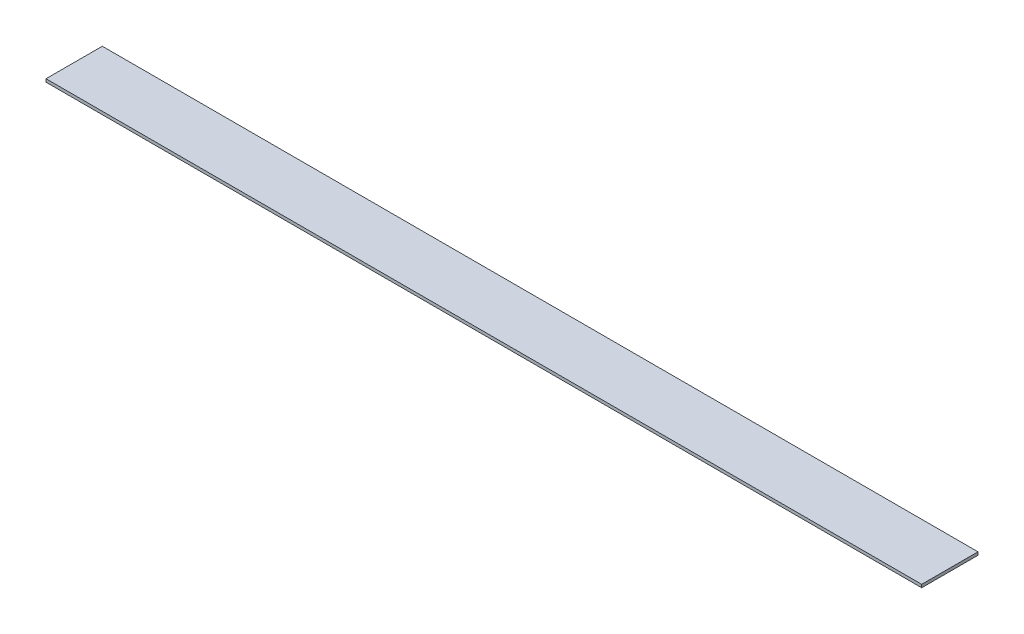
ISO-10303-21;
HEADER;
FILE_DESCRIPTION(('STEP AP214'),'2;1');
FILE_NAME('part.step','',(''),(''),'','','');
FILE_SCHEMA(('AUTOMOTIVE_DESIGN { 1 0 10303 214 1 1 1 1 }'));
ENDSEC;
DATA;
#1=APPLICATION_CONTEXT('core data for automotive mechanical design processes');
#2=APPLICATION_PROTOCOL_DEFINITION('international standard','automotive_design',2000,#1);
#3=PRODUCT_CONTEXT('',#1,'mechanical');
#4=PRODUCT('Part','Part','',(#3));
#5=PRODUCT_RELATED_PRODUCT_CATEGORY('part','',(#4));
#6=PRODUCT_DEFINITION_FORMATION('','',#4);
#7=PRODUCT_DEFINITION_CONTEXT('part definition',#1,'design');
#8=PRODUCT_DEFINITION('design','',#6,#7);
#9=PRODUCT_DEFINITION_SHAPE('','',#8);
#10=(LENGTH_UNIT() NAMED_UNIT(*) SI_UNIT(.MILLI.,.METRE.));
#11=(NAMED_UNIT(*) PLANE_ANGLE_UNIT() SI_UNIT($,.RADIAN.));
#12=(NAMED_UNIT(*) SI_UNIT($,.STERADIAN.) SOLID_ANGLE_UNIT());
#13=UNCERTAINTY_MEASURE_WITH_UNIT(LENGTH_MEASURE(1.E-05),#10,'distance_accuracy_value','');
#14=(GEOMETRIC_REPRESENTATION_CONTEXT(3) GLOBAL_UNCERTAINTY_ASSIGNED_CONTEXT((#13)) GLOBAL_UNIT_ASSIGNED_CONTEXT((#10,
#11,#12)) REPRESENTATION_CONTEXT('',''));
#15=CARTESIAN_POINT('',(0.,0.,0.));
#16=DIRECTION('',(0.,0.,1.));
#17=DIRECTION('',(1.,0.,0.));
#18=AXIS2_PLACEMENT_3D('',#15,#16,#17);
#19=CARTESIAN_POINT('',(0.,3.175,0.));
#20=DIRECTION('',(0.,0.,-1.));
#21=DIRECTION('',(-1.,0.,0.));
#22=AXIS2_PLACEMENT_3D('',#19,#20,#21);
#23=PLANE('',#22);
#24=DIRECTION('',(1.,0.,0.));
#25=VECTOR('',#24,1.);
#26=CARTESIAN_POINT('',(0.,0.,0.));
#27=LINE('',#26,#25);
#28=CARTESIAN_POINT('',(0.,0.,0.));
#29=VERTEX_POINT('',#28);
#30=CARTESIAN_POINT('',(923.925,0.,0.));
#31=VERTEX_POINT('',#30);
#32=EDGE_CURVE('E96',#29,#31,#27,.T.);
#33=ORIENTED_EDGE('',*,*,#32,.T.);
#34=DIRECTION('',(0.,-1.,0.));
#35=VECTOR('',#34,1.);
#36=CARTESIAN_POINT('',(923.925,3.175,0.));
#37=LINE('',#36,#35);
#38=CARTESIAN_POINT('',(923.925,3.175,0.));
#39=VERTEX_POINT('',#38);
#40=EDGE_CURVE('E11',#39,#31,#37,.T.);
#41=ORIENTED_EDGE('',*,*,#40,.F.);
#42=DIRECTION('',(1.,0.,0.));
#43=VECTOR('',#42,1.);
#44=CARTESIAN_POINT('',(0.,3.175,0.));
#45=LINE('',#44,#43);
#46=CARTESIAN_POINT('',(0.,3.175,0.));
#47=VERTEX_POINT('',#46);
#48=EDGE_CURVE('E82',#47,#39,#45,.T.);
#49=ORIENTED_EDGE('',*,*,#48,.F.);
#50=DIRECTION('',(0.,-1.,0.));
#51=VECTOR('',#50,1.);
#52=CARTESIAN_POINT('',(0.,3.175,0.));
#53=LINE('',#52,#51);
#54=EDGE_CURVE('E49',#47,#29,#53,.T.);
#55=ORIENTED_EDGE('',*,*,#54,.T.);
#56=EDGE_LOOP('',(#33,#41,#49,#55));
#57=FACE_BOUND('',#56,.T.);
#58=ADVANCED_FACE('F33',(#57),#23,.F.);
#59=CARTESIAN_POINT('',(923.925,3.175,0.));
#60=DIRECTION('',(-1.,0.,0.));
#61=DIRECTION('',(0.,0.,1.));
#62=AXIS2_PLACEMENT_3D('',#59,#60,#61);
#63=PLANE('',#62);
#64=DIRECTION('',(0.,0.,-1.));
#65=VECTOR('',#64,1.);
#66=CARTESIAN_POINT('',(923.925,0.,0.));
#67=LINE('',#66,#65);
#68=CARTESIAN_POINT('',(923.925,0.,-59.4));
#69=VERTEX_POINT('',#68);
#70=EDGE_CURVE('E87',#31,#69,#67,.T.);
#71=ORIENTED_EDGE('',*,*,#70,.T.);
#72=DIRECTION('',(0.,-1.,0.));
#73=VECTOR('',#72,1.);
#74=CARTESIAN_POINT('',(923.925,3.175,-59.4));
#75=LINE('',#74,#73);
#76=CARTESIAN_POINT('',(923.925,3.175,-59.4));
#77=VERTEX_POINT('',#76);
#78=EDGE_CURVE('E41',#77,#69,#75,.T.);
#79=ORIENTED_EDGE('',*,*,#78,.F.);
#80=DIRECTION('',(0.,0.,-1.));
#81=VECTOR('',#80,1.);
#82=CARTESIAN_POINT('',(923.925,3.175,0.));
#83=LINE('',#82,#81);
#84=EDGE_CURVE('E74',#39,#77,#83,.T.);
#85=ORIENTED_EDGE('',*,*,#84,.F.);
#86=ORIENTED_EDGE('',*,*,#40,.T.);
#87=EDGE_LOOP('',(#71,#79,#85,#86));
#88=FACE_BOUND('',#87,.T.);
#89=ADVANCED_FACE('F86',(#88),#63,.F.);
#90=CARTESIAN_POINT('',(0.,3.175,-59.4));
#91=DIRECTION('',(0.,0.,-1.));
#92=DIRECTION('',(-1.,0.,0.));
#93=AXIS2_PLACEMENT_3D('',#90,#91,#92);
#94=PLANE('',#93);
#95=DIRECTION('',(1.,0.,0.));
#96=VECTOR('',#95,1.);
#97=CARTESIAN_POINT('',(0.,0.,-59.4));
#98=LINE('',#97,#96);
#99=CARTESIAN_POINT('',(0.,0.,-59.4));
#100=VERTEX_POINT('',#99);
#101=EDGE_CURVE('E99',#100,#69,#98,.T.);
#102=ORIENTED_EDGE('',*,*,#101,.F.);
#103=DIRECTION('',(0.,-1.,0.));
#104=VECTOR('',#103,1.);
#105=CARTESIAN_POINT('',(0.,3.175,-59.4));
#106=LINE('',#105,#104);
#107=CARTESIAN_POINT('',(0.,3.175,-59.4));
#108=VERTEX_POINT('',#107);
#109=EDGE_CURVE('E63',#108,#100,#106,.T.);
#110=ORIENTED_EDGE('',*,*,#109,.F.);
#111=DIRECTION('',(1.,0.,0.));
#112=VECTOR('',#111,1.);
#113=CARTESIAN_POINT('',(0.,3.175,-59.4));
#114=LINE('',#113,#112);
#115=EDGE_CURVE('E81',#108,#77,#114,.T.);
#116=ORIENTED_EDGE('',*,*,#115,.T.);
#117=ORIENTED_EDGE('',*,*,#78,.T.);
#118=EDGE_LOOP('',(#102,#110,#116,#117));
#119=FACE_BOUND('',#118,.T.);
#120=ADVANCED_FACE('F90',(#119),#94,.T.);
#121=CARTESIAN_POINT('',(0.,3.175,0.));
#122=DIRECTION('',(-1.,0.,0.));
#123=DIRECTION('',(0.,0.,1.));
#124=AXIS2_PLACEMENT_3D('',#121,#122,#123);
#125=PLANE('',#124);
#126=DIRECTION('',(0.,0.,-1.));
#127=VECTOR('',#126,1.);
#128=CARTESIAN_POINT('',(0.,0.,0.));
#129=LINE('',#128,#127);
#130=EDGE_CURVE('E101',#29,#100,#129,.T.);
#131=ORIENTED_EDGE('',*,*,#130,.F.);
#132=ORIENTED_EDGE('',*,*,#54,.F.);
#133=DIRECTION('',(0.,0.,-1.));
#134=VECTOR('',#133,1.);
#135=CARTESIAN_POINT('',(0.,3.175,0.));
#136=LINE('',#135,#134);
#137=EDGE_CURVE('E91',#47,#108,#136,.T.);
#138=ORIENTED_EDGE('',*,*,#137,.T.);
#139=ORIENTED_EDGE('',*,*,#109,.T.);
#140=EDGE_LOOP('',(#131,#132,#138,#139));
#141=FACE_BOUND('',#140,.T.);
#142=ADVANCED_FACE('F107',(#141),#125,.T.);
#143=CARTESIAN_POINT('',(0.,3.175,0.));
#144=DIRECTION('',(0.,1.,0.));
#145=DIRECTION('',(0.,0.,1.));
#146=AXIS2_PLACEMENT_3D('',#143,#144,#145);
#147=PLANE('',#146);
#148=ORIENTED_EDGE('',*,*,#48,.T.);
#149=ORIENTED_EDGE('',*,*,#84,.T.);
#150=ORIENTED_EDGE('',*,*,#115,.F.);
#151=ORIENTED_EDGE('',*,*,#137,.F.);
#152=EDGE_LOOP('',(#148,#149,#150,#151));
#153=FACE_BOUND('',#152,.T.);
#154=ADVANCED_FACE('F78',(#153),#147,.T.);
#155=CARTESIAN_POINT('',(0.,0.,0.));
#156=DIRECTION('',(0.,1.,0.));
#157=DIRECTION('',(0.,0.,1.));
#158=AXIS2_PLACEMENT_3D('',#155,#156,#157);
#159=PLANE('',#158);
#160=ORIENTED_EDGE('',*,*,#32,.F.);
#161=ORIENTED_EDGE('',*,*,#130,.T.);
#162=ORIENTED_EDGE('',*,*,#101,.T.);
#163=ORIENTED_EDGE('',*,*,#70,.F.);
#164=EDGE_LOOP('',(#160,#161,#162,#163));
#165=FACE_BOUND('',#164,.T.);
#166=ADVANCED_FACE('F106',(#165),#159,.F.);
#167=CLOSED_SHELL('',(#58,#89,#120,#142,#154,#166));
#168=MANIFOLD_SOLID_BREP('B2',#167);
#169=ADVANCED_BREP_SHAPE_REPRESENTATION('',(#18,#168),#14);
#170=SHAPE_DEFINITION_REPRESENTATION(#9,#169);
ENDSEC;
END-ISO-10303-21;
